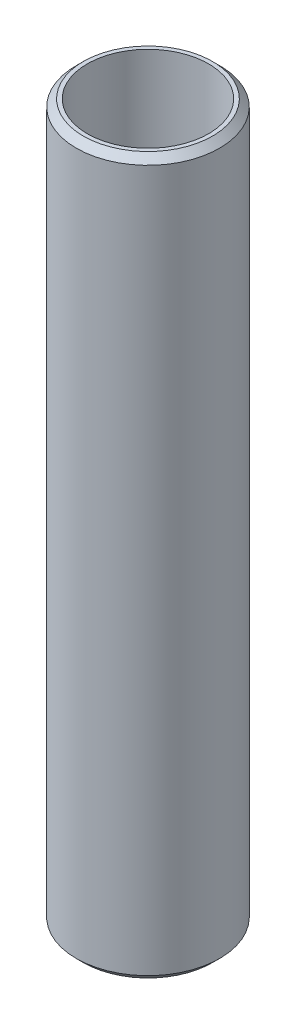
ISO-10303-21;
HEADER;
FILE_DESCRIPTION(('STEP AP214'),'2;1');
FILE_NAME('part.step','',(''),(''),'','','');
FILE_SCHEMA(('AUTOMOTIVE_DESIGN { 1 0 10303 214 1 1 1 1 }'));
ENDSEC;
DATA;
#1=APPLICATION_CONTEXT('core data for automotive mechanical design processes');
#2=APPLICATION_PROTOCOL_DEFINITION('international standard','automotive_design',2000,#1);
#3=PRODUCT_CONTEXT('',#1,'mechanical');
#4=PRODUCT('Part','Part','',(#3));
#5=PRODUCT_RELATED_PRODUCT_CATEGORY('part','',(#4));
#6=PRODUCT_DEFINITION_FORMATION('','',#4);
#7=PRODUCT_DEFINITION_CONTEXT('part definition',#1,'design');
#8=PRODUCT_DEFINITION('design','',#6,#7);
#9=PRODUCT_DEFINITION_SHAPE('','',#8);
#10=(LENGTH_UNIT() NAMED_UNIT(*) SI_UNIT(.MILLI.,.METRE.));
#11=(NAMED_UNIT(*) PLANE_ANGLE_UNIT() SI_UNIT($,.RADIAN.));
#12=(NAMED_UNIT(*) SI_UNIT($,.STERADIAN.) SOLID_ANGLE_UNIT());
#13=UNCERTAINTY_MEASURE_WITH_UNIT(LENGTH_MEASURE(1.E-05),#10,'distance_accuracy_value','');
#14=(GEOMETRIC_REPRESENTATION_CONTEXT(3) GLOBAL_UNCERTAINTY_ASSIGNED_CONTEXT((#13)) GLOBAL_UNIT_ASSIGNED_CONTEXT((#10,
#11,#12)) REPRESENTATION_CONTEXT('',''));
#15=CARTESIAN_POINT('',(0.,0.,0.));
#16=DIRECTION('',(0.,0.,1.));
#17=DIRECTION('',(1.,0.,0.));
#18=AXIS2_PLACEMENT_3D('',#15,#16,#17);
#19=CARTESIAN_POINT('',(0.,549.525610161676,0.));
#20=DIRECTION('',(0.,-1.,0.));
#21=DIRECTION('',(0.,0.,-1.));
#22=AXIS2_PLACEMENT_3D('',#19,#20,#21);
#23=CYLINDRICAL_SURFACE('',#22,55.);
#24=CARTESIAN_POINT('',(0.,544.155875251408,0.));
#25=DIRECTION('',(0.,1.,0.));
#26=DIRECTION('',(0.,0.,1.));
#27=AXIS2_PLACEMENT_3D('',#24,#25,#26);
#28=CIRCLE('',#27,55.);
#29=CARTESIAN_POINT('',(0.,544.155875251408,55.));
#30=VERTEX_POINT('',#29);
#31=EDGE_CURVE('E50',#30,#30,#28,.F.);
#32=ORIENTED_EDGE('',*,*,#31,.T.);
#33=EDGE_LOOP('',(#32));
#34=FACE_BOUND('',#33,.T.);
#35=CARTESIAN_POINT('',(0.,5.36973491026738,0.));
#36=DIRECTION('',(0.,1.,0.));
#37=DIRECTION('',(0.,0.,1.));
#38=AXIS2_PLACEMENT_3D('',#35,#36,#37);
#39=CIRCLE('',#38,55.);
#40=CARTESIAN_POINT('',(0.,5.36973491026738,55.));
#41=VERTEX_POINT('',#40);
#42=EDGE_CURVE('E51',#41,#41,#39,.T.);
#43=ORIENTED_EDGE('',*,*,#42,.T.);
#44=EDGE_LOOP('',(#43));
#45=FACE_BOUND('',#44,.T.);
#46=ADVANCED_FACE('F39',(#34,#45),#23,.T.);
#47=CARTESIAN_POINT('',(0.,549.525610161676,0.));
#48=DIRECTION('',(0.,1.,0.));
#49=DIRECTION('',(0.,0.,1.));
#50=AXIS2_PLACEMENT_3D('',#47,#48,#49);
#51=PLANE('',#50);
#52=CARTESIAN_POINT('',(0.,549.525610161676,0.));
#53=DIRECTION('',(0.,1.,0.));
#54=DIRECTION('',(0.,0.,1.));
#55=AXIS2_PLACEMENT_3D('',#52,#53,#54);
#56=CIRCLE('',#55,49.6302650897327);
#57=CARTESIAN_POINT('',(0.,549.525610161676,49.6302650897327));
#58=VERTEX_POINT('',#57);
#59=EDGE_CURVE('E54',#58,#58,#56,.T.);
#60=ORIENTED_EDGE('',*,*,#59,.T.);
#61=EDGE_LOOP('',(#60));
#62=FACE_BOUND('',#61,.T.);
#63=CARTESIAN_POINT('',(0.,549.525610161676,0.));
#64=DIRECTION('',(0.,1.,0.));
#65=DIRECTION('',(0.,0.,1.));
#66=AXIS2_PLACEMENT_3D('',#63,#64,#65);
#67=CIRCLE('',#66,46.5482856286132);
#68=CARTESIAN_POINT('',(0.,549.525610161676,46.5482856286132));
#69=VERTEX_POINT('',#68);
#70=EDGE_CURVE('E58',#69,#69,#67,.T.);
#71=ORIENTED_EDGE('',*,*,#70,.F.);
#72=EDGE_LOOP('',(#71));
#73=FACE_BOUND('',#72,.T.);
#74=ADVANCED_FACE('F69',(#62,#73),#51,.T.);
#75=CARTESIAN_POINT('',(0.,0.,0.));
#76=DIRECTION('',(0.,1.,0.));
#77=DIRECTION('',(0.,0.,1.));
#78=AXIS2_PLACEMENT_3D('',#75,#76,#77);
#79=PLANE('',#78);
#80=CARTESIAN_POINT('',(0.,0.,0.));
#81=DIRECTION('',(0.,1.,0.));
#82=DIRECTION('',(0.,0.,1.));
#83=AXIS2_PLACEMENT_3D('',#80,#81,#82);
#84=CIRCLE('',#83,49.6302650897326);
#85=CARTESIAN_POINT('',(0.,0.,49.6302650897326));
#86=VERTEX_POINT('',#85);
#87=EDGE_CURVE('E10',#86,#86,#84,.F.);
#88=ORIENTED_EDGE('',*,*,#87,.T.);
#89=EDGE_LOOP('',(#88));
#90=FACE_BOUND('',#89,.T.);
#91=CARTESIAN_POINT('',(0.,0.,0.));
#92=DIRECTION('',(0.,1.,0.));
#93=DIRECTION('',(0.,0.,1.));
#94=AXIS2_PLACEMENT_3D('',#91,#92,#93);
#95=CIRCLE('',#94,46.5482856286132);
#96=CARTESIAN_POINT('',(0.,0.,46.5482856286132));
#97=VERTEX_POINT('',#96);
#98=EDGE_CURVE('E63',#97,#97,#95,.T.);
#99=ORIENTED_EDGE('',*,*,#98,.T.);
#100=EDGE_LOOP('',(#99));
#101=FACE_BOUND('',#100,.T.);
#102=ADVANCED_FACE('F75',(#90,#101),#79,.F.);
#103=CARTESIAN_POINT('',(0.,549.525610161676,0.));
#104=DIRECTION('',(0.,-1.,0.));
#105=DIRECTION('',(0.,0.,-1.));
#106=AXIS2_PLACEMENT_3D('',#103,#104,#105);
#107=CYLINDRICAL_SURFACE('',#106,46.5482856286132);
#108=ORIENTED_EDGE('',*,*,#70,.T.);
#109=EDGE_LOOP('',(#108));
#110=FACE_BOUND('',#109,.T.);
#111=ORIENTED_EDGE('',*,*,#98,.F.);
#112=EDGE_LOOP('',(#111));
#113=FACE_BOUND('',#112,.T.);
#114=ADVANCED_FACE('F70',(#110,#113),#107,.F.);
#115=CARTESIAN_POINT('',(0.,549.525610161676,0.));
#116=DIRECTION('',(0.,-1.,0.));
#117=DIRECTION('',(0.,0.,-1.));
#118=AXIS2_PLACEMENT_3D('',#115,#116,#117);
#119=CONICAL_SURFACE('',#118,49.6302650897327,0.785398163397444);
#120=ORIENTED_EDGE('',*,*,#31,.F.);
#121=EDGE_LOOP('',(#120));
#122=FACE_BOUND('',#121,.T.);
#123=ORIENTED_EDGE('',*,*,#59,.F.);
#124=EDGE_LOOP('',(#123));
#125=FACE_BOUND('',#124,.T.);
#126=ADVANCED_FACE('F81',(#122,#125),#119,.T.);
#127=CARTESIAN_POINT('',(0.,5.36973491026738,0.));
#128=DIRECTION('',(0.,1.,0.));
#129=DIRECTION('',(0.,0.,1.));
#130=AXIS2_PLACEMENT_3D('',#127,#128,#129);
#131=CONICAL_SURFACE('',#130,55.,0.785398163397454);
#132=ORIENTED_EDGE('',*,*,#87,.F.);
#133=EDGE_LOOP('',(#132));
#134=FACE_BOUND('',#133,.T.);
#135=ORIENTED_EDGE('',*,*,#42,.F.);
#136=EDGE_LOOP('',(#135));
#137=FACE_BOUND('',#136,.T.);
#138=ADVANCED_FACE('F45',(#134,#137),#131,.T.);
#139=CLOSED_SHELL('',(#46,#74,#102,#114,#126,#138));
#140=MANIFOLD_SOLID_BREP('B2',#139);
#141=ADVANCED_BREP_SHAPE_REPRESENTATION('',(#18,#140),#14);
#142=SHAPE_DEFINITION_REPRESENTATION(#9,#141);
ENDSEC;
END-ISO-10303-21;
